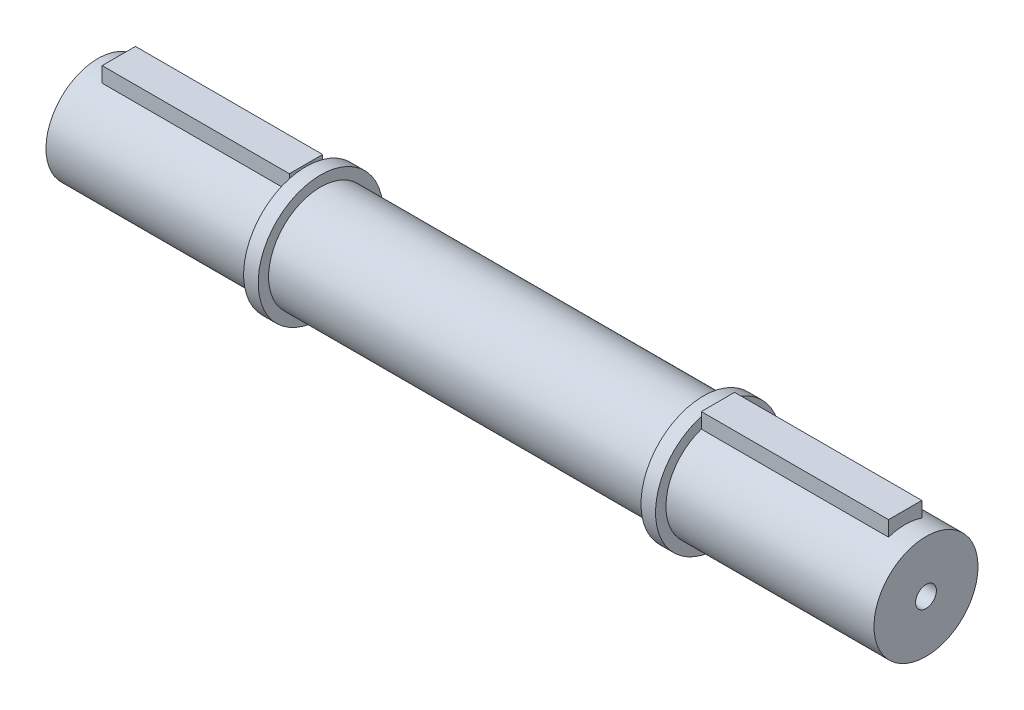
ISO-10303-21;
HEADER;
FILE_DESCRIPTION(('STEP AP214'),'2;1');
FILE_NAME('part.step','',(''),(''),'','','');
FILE_SCHEMA(('AUTOMOTIVE_DESIGN { 1 0 10303 214 1 1 1 1 }'));
ENDSEC;
DATA;
#1=APPLICATION_CONTEXT('core data for automotive mechanical design processes');
#2=APPLICATION_PROTOCOL_DEFINITION('international standard','automotive_design',2000,#1);
#3=PRODUCT_CONTEXT('',#1,'mechanical');
#4=PRODUCT('Part','Part','',(#3));
#5=PRODUCT_RELATED_PRODUCT_CATEGORY('part','',(#4));
#6=PRODUCT_DEFINITION_FORMATION('','',#4);
#7=PRODUCT_DEFINITION_CONTEXT('part definition',#1,'design');
#8=PRODUCT_DEFINITION('design','',#6,#7);
#9=PRODUCT_DEFINITION_SHAPE('','',#8);
#10=(LENGTH_UNIT() NAMED_UNIT(*) SI_UNIT(.MILLI.,.METRE.));
#11=(NAMED_UNIT(*) PLANE_ANGLE_UNIT() SI_UNIT($,.RADIAN.));
#12=(NAMED_UNIT(*) SI_UNIT($,.STERADIAN.) SOLID_ANGLE_UNIT());
#13=UNCERTAINTY_MEASURE_WITH_UNIT(LENGTH_MEASURE(1.E-05),#10,'distance_accuracy_value','');
#14=(GEOMETRIC_REPRESENTATION_CONTEXT(3) GLOBAL_UNCERTAINTY_ASSIGNED_CONTEXT((#13)) GLOBAL_UNIT_ASSIGNED_CONTEXT((#10,
#11,#12)) REPRESENTATION_CONTEXT('',''));
#15=CARTESIAN_POINT('',(0.,0.,0.));
#16=DIRECTION('',(0.,0.,1.));
#17=DIRECTION('',(1.,0.,0.));
#18=AXIS2_PLACEMENT_3D('',#15,#16,#17);
#19=CARTESIAN_POINT('',(99.5,0.,0.));
#20=DIRECTION('',(-1.,0.,0.));
#21=DIRECTION('',(0.,0.,1.));
#22=AXIS2_PLACEMENT_3D('',#19,#20,#21);
#23=CYLINDRICAL_SURFACE('',#22,12.5);
#24=CARTESIAN_POINT('',(-46.,0.,0.));
#25=DIRECTION('',(1.,0.,0.));
#26=DIRECTION('',(0.,0.,-1.));
#27=AXIS2_PLACEMENT_3D('',#24,#25,#26);
#28=CIRCLE('',#27,12.5);
#29=CARTESIAN_POINT('',(-46.,0.,-12.5));
#30=VERTEX_POINT('',#29);
#31=EDGE_CURVE('E53',#30,#30,#28,.T.);
#32=ORIENTED_EDGE('',*,*,#31,.T.);
#33=EDGE_LOOP('',(#32));
#34=FACE_BOUND('',#33,.T.);
#35=CARTESIAN_POINT('',(46.,0.,0.));
#36=DIRECTION('',(1.,0.,0.));
#37=DIRECTION('',(0.,0.,-1.));
#38=AXIS2_PLACEMENT_3D('',#35,#36,#37);
#39=CIRCLE('',#38,12.5);
#40=CARTESIAN_POINT('',(46.,0.,-12.5));
#41=VERTEX_POINT('',#40);
#42=EDGE_CURVE('E219',#41,#41,#39,.T.);
#43=ORIENTED_EDGE('',*,*,#42,.F.);
#44=EDGE_LOOP('',(#43));
#45=FACE_BOUND('',#44,.T.);
#46=ADVANCED_FACE('F50',(#34,#45),#23,.T.);
#47=CARTESIAN_POINT('',(46.,0.,0.));
#48=DIRECTION('',(1.,0.,0.));
#49=DIRECTION('',(0.,0.,-1.));
#50=AXIS2_PLACEMENT_3D('',#47,#48,#49);
#51=PLANE('',#50);
#52=ORIENTED_EDGE('',*,*,#42,.T.);
#53=EDGE_LOOP('',(#52));
#54=FACE_BOUND('',#53,.T.);
#55=CARTESIAN_POINT('',(46.,0.,0.));
#56=DIRECTION('',(1.,0.,0.));
#57=DIRECTION('',(0.,0.,-1.));
#58=AXIS2_PLACEMENT_3D('',#55,#56,#57);
#59=CIRCLE('',#58,15.);
#60=CARTESIAN_POINT('',(46.,0.,-15.));
#61=VERTEX_POINT('',#60);
#62=EDGE_CURVE('E203',#61,#61,#59,.T.);
#63=ORIENTED_EDGE('',*,*,#62,.F.);
#64=EDGE_LOOP('',(#63));
#65=FACE_BOUND('',#64,.T.);
#66=ADVANCED_FACE('F261',(#54,#65),#51,.F.);
#67=CARTESIAN_POINT('',(91.9264068711929,0.,0.));
#68=DIRECTION('',(-1.,0.,0.));
#69=DIRECTION('',(0.,0.,1.));
#70=AXIS2_PLACEMENT_3D('',#67,#68,#69);
#71=CYLINDRICAL_SURFACE('',#70,15.);
#72=CARTESIAN_POINT('',(49.5,0.,0.));
#73=DIRECTION('',(-1.,0.,0.));
#74=DIRECTION('',(0.,0.,1.));
#75=AXIS2_PLACEMENT_3D('',#72,#73,#74);
#76=CIRCLE('',#75,15.);
#77=CARTESIAN_POINT('',(49.5,14.456832294801,4.));
#78=VERTEX_POINT('',#77);
#79=CARTESIAN_POINT('',(49.5,14.456832294801,-4.));
#80=VERTEX_POINT('',#79);
#81=EDGE_CURVE('E207',#78,#80,#76,.T.);
#82=ORIENTED_EDGE('',*,*,#81,.T.);
#83=EDGE_CURVE('E206',#80,#78,#76,.T.);
#84=ORIENTED_EDGE('',*,*,#83,.T.);
#85=EDGE_LOOP('',(#82,#84));
#86=FACE_BOUND('',#85,.T.);
#87=ORIENTED_EDGE('',*,*,#62,.T.);
#88=EDGE_LOOP('',(#87));
#89=FACE_BOUND('',#88,.T.);
#90=ADVANCED_FACE('F242',(#86,#89),#71,.T.);
#91=CARTESIAN_POINT('',(49.5,0.,0.));
#92=DIRECTION('',(-1.,0.,0.));
#93=DIRECTION('',(0.,0.,1.));
#94=AXIS2_PLACEMENT_3D('',#91,#92,#93);
#95=PLANE('',#94);
#96=CARTESIAN_POINT('',(49.5,0.,0.));
#97=DIRECTION('',(-1.,0.,0.));
#98=DIRECTION('',(0.,0.,1.));
#99=AXIS2_PLACEMENT_3D('',#96,#97,#98);
#100=CIRCLE('',#99,12.5);
#101=CARTESIAN_POINT('',(49.5,11.842719282327,-4.));
#102=VERTEX_POINT('',#101);
#103=CARTESIAN_POINT('',(49.5,11.842719282327,4.));
#104=VERTEX_POINT('',#103);
#105=EDGE_CURVE('E214',#102,#104,#100,.T.);
#106=ORIENTED_EDGE('',*,*,#105,.T.);
#107=DIRECTION('',(0.,1.,0.));
#108=VECTOR('',#107,1.);
#109=CARTESIAN_POINT('',(49.5,15.5,4.));
#110=LINE('',#109,#108);
#111=EDGE_CURVE('E183',#104,#78,#110,.T.);
#112=ORIENTED_EDGE('',*,*,#111,.T.);
#113=ORIENTED_EDGE('',*,*,#83,.F.);
#114=DIRECTION('',(0.,-1.,0.));
#115=VECTOR('',#114,1.);
#116=CARTESIAN_POINT('',(49.5,15.5,-4.));
#117=LINE('',#116,#115);
#118=EDGE_CURVE('E179',#80,#102,#117,.T.);
#119=ORIENTED_EDGE('',*,*,#118,.T.);
#120=EDGE_LOOP('',(#106,#112,#113,#119));
#121=FACE_BOUND('',#120,.T.);
#122=ADVANCED_FACE('F239',(#121),#95,.F.);
#123=CARTESIAN_POINT('',(99.5,0.,0.));
#124=DIRECTION('',(1.,0.,0.));
#125=DIRECTION('',(0.,0.,-1.));
#126=AXIS2_PLACEMENT_3D('',#123,#124,#125);
#127=PLANE('',#126);
#128=CARTESIAN_POINT('',(99.5,0.,0.));
#129=DIRECTION('',(1.,0.,0.));
#130=DIRECTION('',(0.,0.,-1.));
#131=AXIS2_PLACEMENT_3D('',#128,#129,#130);
#132=CIRCLE('',#131,2.49999999999999);
#133=CARTESIAN_POINT('',(99.5,0.,-2.49999999999999));
#134=VERTEX_POINT('',#133);
#135=EDGE_CURVE('E313',#134,#134,#132,.T.);
#136=ORIENTED_EDGE('',*,*,#135,.F.);
#137=EDGE_LOOP('',(#136));
#138=FACE_BOUND('',#137,.T.);
#139=CARTESIAN_POINT('',(99.5,0.,0.));
#140=DIRECTION('',(1.,0.,0.));
#141=DIRECTION('',(0.,0.,-1.));
#142=AXIS2_PLACEMENT_3D('',#139,#140,#141);
#143=CIRCLE('',#142,12.5);
#144=CARTESIAN_POINT('',(99.5,0.,-12.5));
#145=VERTEX_POINT('',#144);
#146=EDGE_CURVE('E211',#145,#145,#143,.T.);
#147=ORIENTED_EDGE('',*,*,#146,.T.);
#148=EDGE_LOOP('',(#147));
#149=FACE_BOUND('',#148,.T.);
#150=ADVANCED_FACE('F276',(#138,#149),#127,.T.);
#151=ORIENTED_EDGE('',*,*,#146,.F.);
#152=EDGE_LOOP('',(#151));
#153=FACE_BOUND('',#152,.T.);
#154=CARTESIAN_POINT('',(94.5,0.,0.));
#155=DIRECTION('',(1.,0.,0.));
#156=DIRECTION('',(0.,0.,-1.));
#157=AXIS2_PLACEMENT_3D('',#154,#155,#156);
#158=CIRCLE('',#157,12.5);
#159=CARTESIAN_POINT('',(94.5,11.842719282327,-3.99999999999999));
#160=VERTEX_POINT('',#159);
#161=CARTESIAN_POINT('',(94.5,11.842719282327,4.));
#162=VERTEX_POINT('',#161);
#163=EDGE_CURVE('E58',#160,#162,#158,.T.);
#164=ORIENTED_EDGE('',*,*,#163,.T.);
#165=DIRECTION('',(-1.,0.,0.));
#166=VECTOR('',#165,1.);
#167=CARTESIAN_POINT('',(108.296345959992,11.842719282327,4.));
#168=LINE('',#167,#166);
#169=EDGE_CURVE('E197',#162,#104,#168,.T.);
#170=ORIENTED_EDGE('',*,*,#169,.T.);
#171=ORIENTED_EDGE('',*,*,#105,.F.);
#172=DIRECTION('',(-1.,0.,0.));
#173=VECTOR('',#172,1.);
#174=CARTESIAN_POINT('',(108.296345959992,11.842719282327,-4.));
#175=LINE('',#174,#173);
#176=EDGE_CURVE('E191',#160,#102,#175,.T.);
#177=ORIENTED_EDGE('',*,*,#176,.F.);
#178=EDGE_LOOP('',(#164,#170,#171,#177));
#179=FACE_BOUND('',#178,.T.);
#180=ADVANCED_FACE('F226',(#153,#179),#23,.T.);
#181=CARTESIAN_POINT('',(94.5,0.,0.));
#182=DIRECTION('',(1.,0.,0.));
#183=DIRECTION('',(0.,0.,-1.));
#184=AXIS2_PLACEMENT_3D('',#181,#182,#183);
#185=PLANE('',#184);
#186=ORIENTED_EDGE('',*,*,#163,.F.);
#187=DIRECTION('',(0.,-1.,0.));
#188=VECTOR('',#187,1.);
#189=CARTESIAN_POINT('',(94.5,15.5,-4.));
#190=LINE('',#189,#188);
#191=CARTESIAN_POINT('',(94.5,15.5,-4.));
#192=VERTEX_POINT('',#191);
#193=EDGE_CURVE('E189',#192,#160,#190,.T.);
#194=ORIENTED_EDGE('',*,*,#193,.F.);
#195=DIRECTION('',(0.,0.,-1.));
#196=VECTOR('',#195,1.);
#197=CARTESIAN_POINT('',(94.5,15.5,4.));
#198=LINE('',#197,#196);
#199=CARTESIAN_POINT('',(94.5,15.5,4.));
#200=VERTEX_POINT('',#199);
#201=EDGE_CURVE('E193',#200,#192,#198,.T.);
#202=ORIENTED_EDGE('',*,*,#201,.F.);
#203=DIRECTION('',(0.,1.,0.));
#204=VECTOR('',#203,1.);
#205=CARTESIAN_POINT('',(94.5,15.5,4.));
#206=LINE('',#205,#204);
#207=EDGE_CURVE('E178',#162,#200,#206,.T.);
#208=ORIENTED_EDGE('',*,*,#207,.F.);
#209=EDGE_LOOP('',(#186,#194,#202,#208));
#210=FACE_BOUND('',#209,.T.);
#211=ADVANCED_FACE('F230',(#210),#185,.T.);
#212=CARTESIAN_POINT('',(49.5,0.,0.));
#213=DIRECTION('',(1.,0.,0.));
#214=DIRECTION('',(0.,0.,-1.));
#215=AXIS2_PLACEMENT_3D('',#212,#213,#214);
#216=PLANE('',#215);
#217=CARTESIAN_POINT('',(49.5,15.5,-4.));
#218=VERTEX_POINT('',#217);
#219=EDGE_CURVE('E175',#218,#80,#117,.T.);
#220=ORIENTED_EDGE('',*,*,#219,.T.);
#221=ORIENTED_EDGE('',*,*,#81,.F.);
#222=CARTESIAN_POINT('',(49.5,15.5,4.));
#223=VERTEX_POINT('',#222);
#224=EDGE_CURVE('E174',#78,#223,#110,.T.);
#225=ORIENTED_EDGE('',*,*,#224,.T.);
#226=DIRECTION('',(0.,0.,-1.));
#227=VECTOR('',#226,1.);
#228=CARTESIAN_POINT('',(49.5,15.5,4.));
#229=LINE('',#228,#227);
#230=EDGE_CURVE('E180',#223,#218,#229,.T.);
#231=ORIENTED_EDGE('',*,*,#230,.T.);
#232=EDGE_LOOP('',(#220,#221,#225,#231));
#233=FACE_BOUND('',#232,.T.);
#234=ADVANCED_FACE('F245',(#233),#216,.F.);
#235=CARTESIAN_POINT('',(108.296345959992,15.5,4.));
#236=DIRECTION('',(0.,0.,1.));
#237=DIRECTION('',(0.,-1.,0.));
#238=AXIS2_PLACEMENT_3D('',#235,#236,#237);
#239=PLANE('',#238);
#240=ORIENTED_EDGE('',*,*,#169,.F.);
#241=ORIENTED_EDGE('',*,*,#207,.T.);
#242=DIRECTION('',(-1.,0.,0.));
#243=VECTOR('',#242,1.);
#244=CARTESIAN_POINT('',(108.296345959992,15.5,4.));
#245=LINE('',#244,#243);
#246=EDGE_CURVE('E188',#200,#223,#245,.T.);
#247=ORIENTED_EDGE('',*,*,#246,.T.);
#248=ORIENTED_EDGE('',*,*,#224,.F.);
#249=ORIENTED_EDGE('',*,*,#111,.F.);
#250=EDGE_LOOP('',(#240,#241,#247,#248,#249));
#251=FACE_BOUND('',#250,.T.);
#252=ADVANCED_FACE('F234',(#251),#239,.T.);
#253=CARTESIAN_POINT('',(108.296345959992,15.5,4.));
#254=DIRECTION('',(0.,1.,0.));
#255=DIRECTION('',(0.,0.,1.));
#256=AXIS2_PLACEMENT_3D('',#253,#254,#255);
#257=PLANE('',#256);
#258=ORIENTED_EDGE('',*,*,#246,.F.);
#259=ORIENTED_EDGE('',*,*,#201,.T.);
#260=DIRECTION('',(-1.,0.,0.));
#261=VECTOR('',#260,1.);
#262=CARTESIAN_POINT('',(108.296345959992,15.5,-4.));
#263=LINE('',#262,#261);
#264=EDGE_CURVE('E192',#192,#218,#263,.T.);
#265=ORIENTED_EDGE('',*,*,#264,.T.);
#266=ORIENTED_EDGE('',*,*,#230,.F.);
#267=EDGE_LOOP('',(#258,#259,#265,#266));
#268=FACE_BOUND('',#267,.T.);
#269=ADVANCED_FACE('F251',(#268),#257,.T.);
#270=CARTESIAN_POINT('',(108.296345959992,15.5,-4.));
#271=DIRECTION('',(0.,0.,-1.));
#272=DIRECTION('',(0.,1.,0.));
#273=AXIS2_PLACEMENT_3D('',#270,#271,#272);
#274=PLANE('',#273);
#275=ORIENTED_EDGE('',*,*,#264,.F.);
#276=ORIENTED_EDGE('',*,*,#193,.T.);
#277=ORIENTED_EDGE('',*,*,#176,.T.);
#278=ORIENTED_EDGE('',*,*,#118,.F.);
#279=ORIENTED_EDGE('',*,*,#219,.F.);
#280=EDGE_LOOP('',(#275,#276,#277,#278,#279));
#281=FACE_BOUND('',#280,.T.);
#282=ADVANCED_FACE('F249',(#281),#274,.T.);
#283=CARTESIAN_POINT('',(-49.5,0.,0.));
#284=DIRECTION('',(-1.,0.,0.));
#285=DIRECTION('',(0.,0.,1.));
#286=AXIS2_PLACEMENT_3D('',#283,#284,#285);
#287=PLANE('',#286);
#288=CARTESIAN_POINT('',(-49.5,0.,0.));
#289=DIRECTION('',(-1.,0.,0.));
#290=DIRECTION('',(0.,0.,1.));
#291=AXIS2_PLACEMENT_3D('',#288,#289,#290);
#292=CIRCLE('',#291,12.5);
#293=CARTESIAN_POINT('',(-49.5,11.8427192822992,-4.00000000008239));
#294=VERTEX_POINT('',#293);
#295=CARTESIAN_POINT('',(-49.5,11.8427192823122,4.00000000004372));
#296=VERTEX_POINT('',#295);
#297=EDGE_CURVE('E153',#294,#296,#292,.T.);
#298=ORIENTED_EDGE('',*,*,#297,.F.);
#299=DIRECTION('',(0.,1.,0.));
#300=VECTOR('',#299,1.);
#301=CARTESIAN_POINT('',(-49.5,-291586.25,-3.99999999990541));
#302=LINE('',#301,#300);
#303=CARTESIAN_POINT('',(-49.5,14.4568322947889,-4.00000000004373));
#304=VERTEX_POINT('',#303);
#305=EDGE_CURVE('E148',#294,#304,#302,.T.);
#306=ORIENTED_EDGE('',*,*,#305,.T.);
#307=CARTESIAN_POINT('',(-49.5,0.,0.));
#308=DIRECTION('',(-1.,0.,0.));
#309=DIRECTION('',(0.,0.,1.));
#310=AXIS2_PLACEMENT_3D('',#307,#308,#309);
#311=CIRCLE('',#310,15.);
#312=CARTESIAN_POINT('',(-49.5,14.4568322947889,4.00000000004372));
#313=VERTEX_POINT('',#312);
#314=EDGE_CURVE('E146',#313,#304,#311,.F.);
#315=ORIENTED_EDGE('',*,*,#314,.F.);
#316=DIRECTION('',(0.,-1.,0.));
#317=VECTOR('',#316,1.);
#318=CARTESIAN_POINT('',(-49.5,-291586.25,3.99999999990541));
#319=LINE('',#318,#317);
#320=EDGE_CURVE('E134',#313,#296,#319,.T.);
#321=ORIENTED_EDGE('',*,*,#320,.T.);
#322=EDGE_LOOP('',(#298,#306,#315,#321));
#323=FACE_BOUND('',#322,.T.);
#324=ADVANCED_FACE('F147',(#323),#287,.T.);
#325=CARTESIAN_POINT('',(-46.,0.,0.));
#326=DIRECTION('',(1.,0.,0.));
#327=DIRECTION('',(0.,0.,-1.));
#328=AXIS2_PLACEMENT_3D('',#325,#326,#327);
#329=PLANE('',#328);
#330=ORIENTED_EDGE('',*,*,#31,.F.);
#331=EDGE_LOOP('',(#330));
#332=FACE_BOUND('',#331,.T.);
#333=CARTESIAN_POINT('',(-46.,0.,0.));
#334=DIRECTION('',(1.,0.,0.));
#335=DIRECTION('',(0.,0.,-1.));
#336=AXIS2_PLACEMENT_3D('',#333,#334,#335);
#337=CIRCLE('',#336,15.);
#338=CARTESIAN_POINT('',(-46.,0.,-15.));
#339=VERTEX_POINT('',#338);
#340=EDGE_CURVE('E150',#339,#339,#337,.T.);
#341=ORIENTED_EDGE('',*,*,#340,.T.);
#342=EDGE_LOOP('',(#341));
#343=FACE_BOUND('',#342,.T.);
#344=ADVANCED_FACE('F304',(#332,#343),#329,.T.);
#345=CARTESIAN_POINT('',(-91.9264068711929,0.,0.));
#346=DIRECTION('',(1.,0.,0.));
#347=DIRECTION('',(0.,0.,-1.));
#348=AXIS2_PLACEMENT_3D('',#345,#346,#347);
#349=CYLINDRICAL_SURFACE('',#348,15.);
#350=ORIENTED_EDGE('',*,*,#340,.F.);
#351=EDGE_LOOP('',(#350));
#352=FACE_BOUND('',#351,.T.);
#353=EDGE_CURVE('E65',#304,#313,#311,.F.);
#354=ORIENTED_EDGE('',*,*,#353,.T.);
#355=ORIENTED_EDGE('',*,*,#314,.T.);
#356=EDGE_LOOP('',(#354,#355));
#357=FACE_BOUND('',#356,.T.);
#358=ADVANCED_FACE('F152',(#352,#357),#349,.T.);
#359=CARTESIAN_POINT('',(-99.5,0.,0.));
#360=DIRECTION('',(1.,0.,0.));
#361=DIRECTION('',(0.,0.,-1.));
#362=AXIS2_PLACEMENT_3D('',#359,#360,#361);
#363=PLANE('',#362);
#364=CARTESIAN_POINT('',(-99.5,0.,0.));
#365=DIRECTION('',(1.,0.,0.));
#366=DIRECTION('',(0.,0.,-1.));
#367=AXIS2_PLACEMENT_3D('',#364,#365,#366);
#368=CIRCLE('',#367,2.49999999999997);
#369=CARTESIAN_POINT('',(-99.5,0.,-2.49999999999997));
#370=VERTEX_POINT('',#369);
#371=EDGE_CURVE('E310',#370,#370,#368,.T.);
#372=ORIENTED_EDGE('',*,*,#371,.T.);
#373=EDGE_LOOP('',(#372));
#374=FACE_BOUND('',#373,.T.);
#375=CARTESIAN_POINT('',(-99.5,0.,0.));
#376=DIRECTION('',(1.,0.,0.));
#377=DIRECTION('',(0.,0.,-1.));
#378=AXIS2_PLACEMENT_3D('',#375,#376,#377);
#379=CIRCLE('',#378,12.5);
#380=CARTESIAN_POINT('',(-99.5,0.,-12.5));
#381=VERTEX_POINT('',#380);
#382=EDGE_CURVE('E210',#381,#381,#379,.T.);
#383=ORIENTED_EDGE('',*,*,#382,.F.);
#384=EDGE_LOOP('',(#383));
#385=FACE_BOUND('',#384,.T.);
#386=ADVANCED_FACE('F293',(#374,#385),#363,.F.);
#387=CARTESIAN_POINT('',(-94.5,0.,0.));
#388=DIRECTION('',(1.,0.,0.));
#389=DIRECTION('',(0.,0.,-1.));
#390=AXIS2_PLACEMENT_3D('',#387,#388,#389);
#391=PLANE('',#390);
#392=DIRECTION('',(0.,-1.,0.));
#393=VECTOR('',#392,1.);
#394=CARTESIAN_POINT('',(-94.5,-291586.25,-3.99999999990541));
#395=LINE('',#394,#393);
#396=CARTESIAN_POINT('',(-94.5,15.4999999999745,-4.00000000004373));
#397=VERTEX_POINT('',#396);
#398=CARTESIAN_POINT('',(-94.5,11.8427192822992,-4.00000000008239));
#399=VERTEX_POINT('',#398);
#400=EDGE_CURVE('E158',#397,#399,#395,.T.);
#401=ORIENTED_EDGE('',*,*,#400,.T.);
#402=CARTESIAN_POINT('',(-94.5,0.,0.));
#403=DIRECTION('',(1.,0.,0.));
#404=DIRECTION('',(0.,0.,-1.));
#405=AXIS2_PLACEMENT_3D('',#402,#403,#404);
#406=CIRCLE('',#405,12.5);
#407=CARTESIAN_POINT('',(-94.5,11.8427192822992,4.0000000000191));
#408=VERTEX_POINT('',#407);
#409=EDGE_CURVE('E14',#399,#408,#406,.T.);
#410=ORIENTED_EDGE('',*,*,#409,.T.);
#411=DIRECTION('',(0.,1.,0.));
#412=VECTOR('',#411,1.);
#413=CARTESIAN_POINT('',(-94.5,-291586.25,3.99999999990541));
#414=LINE('',#413,#412);
#415=CARTESIAN_POINT('',(-94.5,15.4999999999745,4.00000000004373));
#416=VERTEX_POINT('',#415);
#417=EDGE_CURVE('E164',#408,#416,#414,.T.);
#418=ORIENTED_EDGE('',*,*,#417,.T.);
#419=DIRECTION('',(0.,0.,-1.));
#420=VECTOR('',#419,1.);
#421=CARTESIAN_POINT('',(-94.5,15.4999999999745,-400000.));
#422=LINE('',#421,#420);
#423=EDGE_CURVE('E161',#416,#397,#422,.T.);
#424=ORIENTED_EDGE('',*,*,#423,.T.);
#425=EDGE_LOOP('',(#401,#410,#418,#424));
#426=FACE_BOUND('',#425,.T.);
#427=ADVANCED_FACE('F295',(#426),#391,.F.);
#428=CARTESIAN_POINT('',(-108.296345960072,15.4999999999745,-400000.));
#429=DIRECTION('',(0.,1.,0.));
#430=DIRECTION('',(0.,0.,1.));
#431=AXIS2_PLACEMENT_3D('',#428,#429,#430);
#432=PLANE('',#431);
#433=ORIENTED_EDGE('',*,*,#423,.F.);
#434=DIRECTION('',(1.,0.,0.));
#435=VECTOR('',#434,1.);
#436=CARTESIAN_POINT('',(-108.296345960072,15.4999999999745,4.00000000004373));
#437=LINE('',#436,#435);
#438=CARTESIAN_POINT('',(-49.5,15.4999999999745,4.00000000004373));
#439=VERTEX_POINT('',#438);
#440=EDGE_CURVE('E167',#416,#439,#437,.T.);
#441=ORIENTED_EDGE('',*,*,#440,.T.);
#442=DIRECTION('',(0.,0.,1.));
#443=VECTOR('',#442,1.);
#444=CARTESIAN_POINT('',(-49.5,15.4999999999745,-400000.));
#445=LINE('',#444,#443);
#446=CARTESIAN_POINT('',(-49.5,15.4999999999745,-4.00000000004373));
#447=VERTEX_POINT('',#446);
#448=EDGE_CURVE('E130',#447,#439,#445,.T.);
#449=ORIENTED_EDGE('',*,*,#448,.F.);
#450=DIRECTION('',(1.,0.,0.));
#451=VECTOR('',#450,1.);
#452=CARTESIAN_POINT('',(-108.296345960072,15.4999999999745,-4.00000000004373));
#453=LINE('',#452,#451);
#454=EDGE_CURVE('E162',#397,#447,#453,.T.);
#455=ORIENTED_EDGE('',*,*,#454,.F.);
#456=EDGE_LOOP('',(#433,#441,#449,#455));
#457=FACE_BOUND('',#456,.T.);
#458=ADVANCED_FACE('F301',(#457),#432,.T.);
#459=CARTESIAN_POINT('',(-49.5,0.,0.));
#460=DIRECTION('',(1.,0.,0.));
#461=DIRECTION('',(0.,0.,-1.));
#462=AXIS2_PLACEMENT_3D('',#459,#460,#461);
#463=PLANE('',#462);
#464=ORIENTED_EDGE('',*,*,#353,.F.);
#465=EDGE_CURVE('E133',#304,#447,#302,.T.);
#466=ORIENTED_EDGE('',*,*,#465,.T.);
#467=ORIENTED_EDGE('',*,*,#448,.T.);
#468=EDGE_CURVE('E126',#439,#313,#319,.T.);
#469=ORIENTED_EDGE('',*,*,#468,.T.);
#470=EDGE_LOOP('',(#464,#466,#467,#469));
#471=FACE_BOUND('',#470,.T.);
#472=ADVANCED_FACE('F128',(#471),#463,.T.);
#473=CARTESIAN_POINT('',(-108.296345960072,-291586.25,3.99999999990541));
#474=DIRECTION('',(0.,0.,1.));
#475=DIRECTION('',(0.,-1.,0.));
#476=AXIS2_PLACEMENT_3D('',#473,#474,#475);
#477=PLANE('',#476);
#478=ORIENTED_EDGE('',*,*,#417,.F.);
#479=DIRECTION('',(1.,0.,0.));
#480=VECTOR('',#479,1.);
#481=CARTESIAN_POINT('',(-108.296345960072,11.8427192822992,4.0000000000191));
#482=LINE('',#481,#480);
#483=EDGE_CURVE('E141',#408,#296,#482,.T.);
#484=ORIENTED_EDGE('',*,*,#483,.T.);
#485=ORIENTED_EDGE('',*,*,#320,.F.);
#486=ORIENTED_EDGE('',*,*,#468,.F.);
#487=ORIENTED_EDGE('',*,*,#440,.F.);
#488=EDGE_LOOP('',(#478,#484,#485,#486,#487));
#489=FACE_BOUND('',#488,.T.);
#490=ADVANCED_FACE('F140',(#489),#477,.T.);
#491=CARTESIAN_POINT('',(-108.296345960072,-291586.25,-3.99999999990541));
#492=DIRECTION('',(0.,0.,-1.));
#493=DIRECTION('',(0.,1.,0.));
#494=AXIS2_PLACEMENT_3D('',#491,#492,#493);
#495=PLANE('',#494);
#496=ORIENTED_EDGE('',*,*,#400,.F.);
#497=ORIENTED_EDGE('',*,*,#454,.T.);
#498=ORIENTED_EDGE('',*,*,#465,.F.);
#499=ORIENTED_EDGE('',*,*,#305,.F.);
#500=DIRECTION('',(1.,0.,0.));
#501=VECTOR('',#500,1.);
#502=CARTESIAN_POINT('',(-108.296345960072,11.8427192822992,-4.00000000004372));
#503=LINE('',#502,#501);
#504=EDGE_CURVE('E73',#399,#294,#503,.T.);
#505=ORIENTED_EDGE('',*,*,#504,.F.);
#506=EDGE_LOOP('',(#496,#497,#498,#499,#505));
#507=FACE_BOUND('',#506,.T.);
#508=ADVANCED_FACE('F273',(#507),#495,.T.);
#509=ORIENTED_EDGE('',*,*,#382,.T.);
#510=EDGE_LOOP('',(#509));
#511=FACE_BOUND('',#510,.T.);
#512=ORIENTED_EDGE('',*,*,#504,.T.);
#513=ORIENTED_EDGE('',*,*,#297,.T.);
#514=ORIENTED_EDGE('',*,*,#483,.F.);
#515=ORIENTED_EDGE('',*,*,#409,.F.);
#516=EDGE_LOOP('',(#512,#513,#514,#515));
#517=FACE_BOUND('',#516,.T.);
#518=ADVANCED_FACE('F263',(#511,#517),#23,.T.);
#519=CARTESIAN_POINT('',(99.5,0.,0.));
#520=DIRECTION('',(1.,0.,0.));
#521=DIRECTION('',(0.,0.,-1.));
#522=AXIS2_PLACEMENT_3D('',#519,#520,#521);
#523=CYLINDRICAL_SURFACE('',#522,2.49999999999998);
#524=ORIENTED_EDGE('',*,*,#371,.F.);
#525=EDGE_LOOP('',(#524));
#526=FACE_BOUND('',#525,.T.);
#527=ORIENTED_EDGE('',*,*,#135,.T.);
#528=EDGE_LOOP('',(#527));
#529=FACE_BOUND('',#528,.T.);
#530=ADVANCED_FACE('F272',(#526,#529),#523,.F.);
#531=CLOSED_SHELL('',(#46,#66,#90,#122,#150,#180,#211,#234,#252,#269,#282,#324,#344,#358,#386,
#427,#458,#472,#490,#508,#518,#530));
#532=MANIFOLD_SOLID_BREP('B2',#531);
#533=ADVANCED_BREP_SHAPE_REPRESENTATION('',(#18,#532),#14);
#534=SHAPE_DEFINITION_REPRESENTATION(#9,#533);
ENDSEC;
END-ISO-10303-21;
